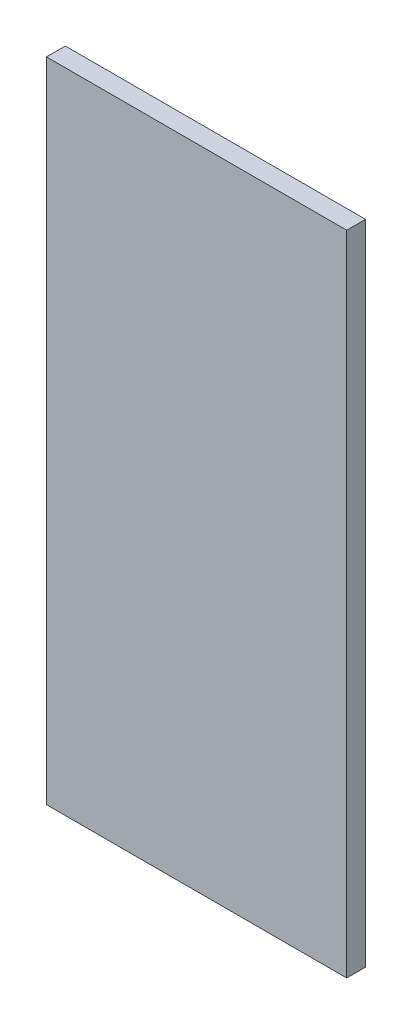
ISO-10303-21;
HEADER;
FILE_DESCRIPTION(('STEP AP214'),'2;1');
FILE_NAME('part.step','',(''),(''),'','','');
FILE_SCHEMA(('AUTOMOTIVE_DESIGN { 1 0 10303 214 1 1 1 1 }'));
ENDSEC;
DATA;
#1=APPLICATION_CONTEXT('core data for automotive mechanical design processes');
#2=APPLICATION_PROTOCOL_DEFINITION('international standard','automotive_design',2000,#1);
#3=PRODUCT_CONTEXT('',#1,'mechanical');
#4=PRODUCT('Part','Part','',(#3));
#5=PRODUCT_RELATED_PRODUCT_CATEGORY('part','',(#4));
#6=PRODUCT_DEFINITION_FORMATION('','',#4);
#7=PRODUCT_DEFINITION_CONTEXT('part definition',#1,'design');
#8=PRODUCT_DEFINITION('design','',#6,#7);
#9=PRODUCT_DEFINITION_SHAPE('','',#8);
#10=(LENGTH_UNIT() NAMED_UNIT(*) SI_UNIT(.MILLI.,.METRE.));
#11=(NAMED_UNIT(*) PLANE_ANGLE_UNIT() SI_UNIT($,.RADIAN.));
#12=(NAMED_UNIT(*) SI_UNIT($,.STERADIAN.) SOLID_ANGLE_UNIT());
#13=UNCERTAINTY_MEASURE_WITH_UNIT(LENGTH_MEASURE(1.E-05),#10,'distance_accuracy_value','');
#14=(GEOMETRIC_REPRESENTATION_CONTEXT(3) GLOBAL_UNCERTAINTY_ASSIGNED_CONTEXT((#13)) GLOBAL_UNIT_ASSIGNED_CONTEXT((#10,
#11,#12)) REPRESENTATION_CONTEXT('',''));
#15=CARTESIAN_POINT('',(0.,0.,0.));
#16=DIRECTION('',(0.,0.,1.));
#17=DIRECTION('',(1.,0.,0.));
#18=AXIS2_PLACEMENT_3D('',#15,#16,#17);
#19=CARTESIAN_POINT('',(-127.5,275.,16.));
#20=DIRECTION('',(0.,1.,0.));
#21=DIRECTION('',(0.,0.,1.));
#22=AXIS2_PLACEMENT_3D('',#19,#20,#21);
#23=PLANE('',#22);
#24=DIRECTION('',(1.,0.,0.));
#25=VECTOR('',#24,1.);
#26=CARTESIAN_POINT('',(-127.5,275.,0.));
#27=LINE('',#26,#25);
#28=CARTESIAN_POINT('',(-127.5,275.,0.));
#29=VERTEX_POINT('',#28);
#30=CARTESIAN_POINT('',(127.5,275.,0.));
#31=VERTEX_POINT('',#30);
#32=EDGE_CURVE('E99',#29,#31,#27,.T.);
#33=ORIENTED_EDGE('',*,*,#32,.F.);
#34=DIRECTION('',(0.,0.,-1.));
#35=VECTOR('',#34,1.);
#36=CARTESIAN_POINT('',(-127.5,275.,16.));
#37=LINE('',#36,#35);
#38=CARTESIAN_POINT('',(-127.5,275.,16.));
#39=VERTEX_POINT('',#38);
#40=EDGE_CURVE('E11',#39,#29,#37,.T.);
#41=ORIENTED_EDGE('',*,*,#40,.F.);
#42=DIRECTION('',(1.,0.,0.));
#43=VECTOR('',#42,1.);
#44=CARTESIAN_POINT('',(-127.5,275.,16.));
#45=LINE('',#44,#43);
#46=CARTESIAN_POINT('',(127.5,275.,16.));
#47=VERTEX_POINT('',#46);
#48=EDGE_CURVE('E94',#39,#47,#45,.T.);
#49=ORIENTED_EDGE('',*,*,#48,.T.);
#50=DIRECTION('',(0.,0.,-1.));
#51=VECTOR('',#50,1.);
#52=CARTESIAN_POINT('',(127.5,275.,16.));
#53=LINE('',#52,#51);
#54=EDGE_CURVE('E37',#47,#31,#53,.T.);
#55=ORIENTED_EDGE('',*,*,#54,.T.);
#56=EDGE_LOOP('',(#33,#41,#49,#55));
#57=FACE_BOUND('',#56,.T.);
#58=ADVANCED_FACE('F34',(#57),#23,.T.);
#59=CARTESIAN_POINT('',(-127.5,275.,16.));
#60=DIRECTION('',(1.,0.,0.));
#61=DIRECTION('',(0.,0.,-1.));
#62=AXIS2_PLACEMENT_3D('',#59,#60,#61);
#63=PLANE('',#62);
#64=DIRECTION('',(0.,-1.,0.));
#65=VECTOR('',#64,1.);
#66=CARTESIAN_POINT('',(-127.5,275.,0.));
#67=LINE('',#66,#65);
#68=CARTESIAN_POINT('',(-127.5,-275.,0.));
#69=VERTEX_POINT('',#68);
#70=EDGE_CURVE('E67',#29,#69,#67,.T.);
#71=ORIENTED_EDGE('',*,*,#70,.T.);
#72=DIRECTION('',(0.,0.,-1.));
#73=VECTOR('',#72,1.);
#74=CARTESIAN_POINT('',(-127.5,-275.,16.));
#75=LINE('',#74,#73);
#76=CARTESIAN_POINT('',(-127.5,-275.,16.));
#77=VERTEX_POINT('',#76);
#78=EDGE_CURVE('E43',#77,#69,#75,.T.);
#79=ORIENTED_EDGE('',*,*,#78,.F.);
#80=DIRECTION('',(0.,-1.,0.));
#81=VECTOR('',#80,1.);
#82=CARTESIAN_POINT('',(-127.5,275.,16.));
#83=LINE('',#82,#81);
#84=EDGE_CURVE('E84',#39,#77,#83,.T.);
#85=ORIENTED_EDGE('',*,*,#84,.F.);
#86=ORIENTED_EDGE('',*,*,#40,.T.);
#87=EDGE_LOOP('',(#71,#79,#85,#86));
#88=FACE_BOUND('',#87,.T.);
#89=ADVANCED_FACE('F109',(#88),#63,.F.);
#90=CARTESIAN_POINT('',(-127.5,-275.,16.));
#91=DIRECTION('',(0.,1.,0.));
#92=DIRECTION('',(0.,0.,1.));
#93=AXIS2_PLACEMENT_3D('',#90,#91,#92);
#94=PLANE('',#93);
#95=DIRECTION('',(1.,0.,0.));
#96=VECTOR('',#95,1.);
#97=CARTESIAN_POINT('',(-127.5,-275.,0.));
#98=LINE('',#97,#96);
#99=CARTESIAN_POINT('',(127.5,-275.,0.));
#100=VERTEX_POINT('',#99);
#101=EDGE_CURVE('E91',#69,#100,#98,.T.);
#102=ORIENTED_EDGE('',*,*,#101,.T.);
#103=DIRECTION('',(0.,0.,-1.));
#104=VECTOR('',#103,1.);
#105=CARTESIAN_POINT('',(127.5,-275.,16.));
#106=LINE('',#105,#104);
#107=CARTESIAN_POINT('',(127.5,-275.,16.));
#108=VERTEX_POINT('',#107);
#109=EDGE_CURVE('E88',#108,#100,#106,.T.);
#110=ORIENTED_EDGE('',*,*,#109,.F.);
#111=DIRECTION('',(1.,0.,0.));
#112=VECTOR('',#111,1.);
#113=CARTESIAN_POINT('',(-127.5,-275.,16.));
#114=LINE('',#113,#112);
#115=EDGE_CURVE('E79',#77,#108,#114,.T.);
#116=ORIENTED_EDGE('',*,*,#115,.F.);
#117=ORIENTED_EDGE('',*,*,#78,.T.);
#118=EDGE_LOOP('',(#102,#110,#116,#117));
#119=FACE_BOUND('',#118,.T.);
#120=ADVANCED_FACE('F89',(#119),#94,.F.);
#121=CARTESIAN_POINT('',(127.5,275.,16.));
#122=DIRECTION('',(1.,0.,0.));
#123=DIRECTION('',(0.,0.,-1.));
#124=AXIS2_PLACEMENT_3D('',#121,#122,#123);
#125=PLANE('',#124);
#126=DIRECTION('',(0.,-1.,0.));
#127=VECTOR('',#126,1.);
#128=CARTESIAN_POINT('',(127.5,275.,0.));
#129=LINE('',#128,#127);
#130=EDGE_CURVE('E102',#31,#100,#129,.T.);
#131=ORIENTED_EDGE('',*,*,#130,.F.);
#132=ORIENTED_EDGE('',*,*,#54,.F.);
#133=DIRECTION('',(0.,-1.,0.));
#134=VECTOR('',#133,1.);
#135=CARTESIAN_POINT('',(127.5,275.,16.));
#136=LINE('',#135,#134);
#137=EDGE_CURVE('E83',#47,#108,#136,.T.);
#138=ORIENTED_EDGE('',*,*,#137,.T.);
#139=ORIENTED_EDGE('',*,*,#109,.T.);
#140=EDGE_LOOP('',(#131,#132,#138,#139));
#141=FACE_BOUND('',#140,.T.);
#142=ADVANCED_FACE('F93',(#141),#125,.T.);
#143=CARTESIAN_POINT('',(0.,0.,16.));
#144=DIRECTION('',(0.,0.,-1.));
#145=DIRECTION('',(-1.,0.,0.));
#146=AXIS2_PLACEMENT_3D('',#143,#144,#145);
#147=PLANE('',#146);
#148=ORIENTED_EDGE('',*,*,#48,.F.);
#149=ORIENTED_EDGE('',*,*,#84,.T.);
#150=ORIENTED_EDGE('',*,*,#115,.T.);
#151=ORIENTED_EDGE('',*,*,#137,.F.);
#152=EDGE_LOOP('',(#148,#149,#150,#151));
#153=FACE_BOUND('',#152,.T.);
#154=ADVANCED_FACE('F82',(#153),#147,.F.);
#155=CARTESIAN_POINT('',(0.,0.,0.));
#156=DIRECTION('',(0.,0.,-1.));
#157=DIRECTION('',(-1.,0.,0.));
#158=AXIS2_PLACEMENT_3D('',#155,#156,#157);
#159=PLANE('',#158);
#160=ORIENTED_EDGE('',*,*,#32,.T.);
#161=ORIENTED_EDGE('',*,*,#130,.T.);
#162=ORIENTED_EDGE('',*,*,#101,.F.);
#163=ORIENTED_EDGE('',*,*,#70,.F.);
#164=EDGE_LOOP('',(#160,#161,#162,#163));
#165=FACE_BOUND('',#164,.T.);
#166=ADVANCED_FACE('F107',(#165),#159,.T.);
#167=CLOSED_SHELL('',(#58,#89,#120,#142,#154,#166));
#168=MANIFOLD_SOLID_BREP('B2',#167);
#169=ADVANCED_BREP_SHAPE_REPRESENTATION('',(#18,#168),#14);
#170=SHAPE_DEFINITION_REPRESENTATION(#9,#169);
ENDSEC;
END-ISO-10303-21;
